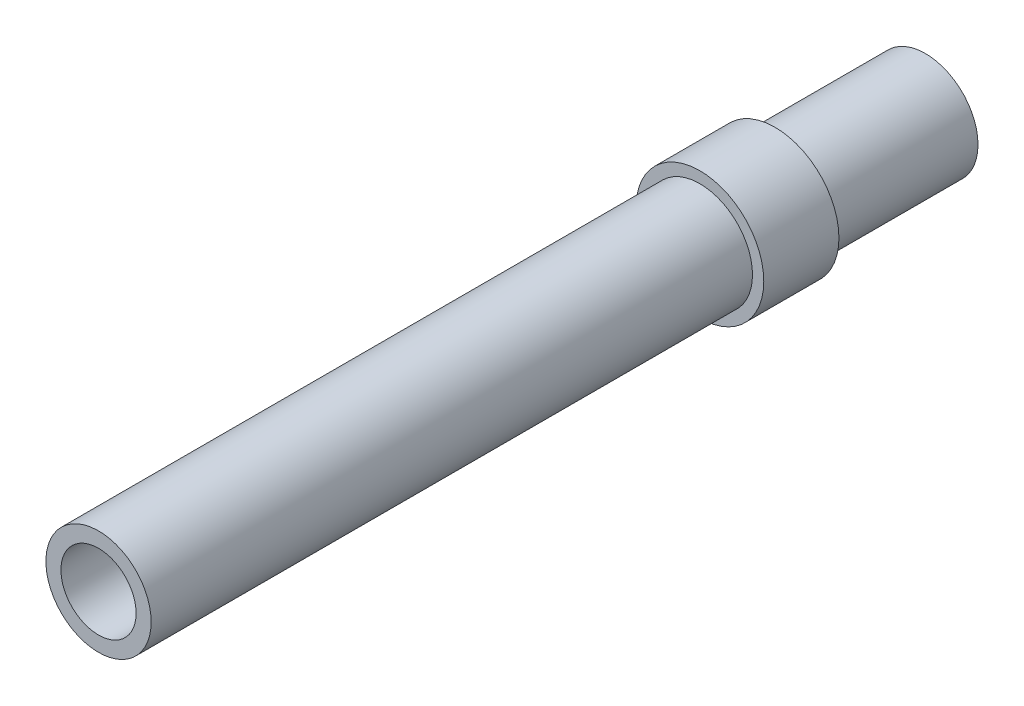
ISO-10303-21;
HEADER;
FILE_DESCRIPTION(('STEP AP214'),'2;1');
FILE_NAME('part.step','',(''),(''),'','','');
FILE_SCHEMA(('AUTOMOTIVE_DESIGN { 1 0 10303 214 1 1 1 1 }'));
ENDSEC;
DATA;
#1=APPLICATION_CONTEXT('core data for automotive mechanical design processes');
#2=APPLICATION_PROTOCOL_DEFINITION('international standard','automotive_design',2000,#1);
#3=PRODUCT_CONTEXT('',#1,'mechanical');
#4=PRODUCT('Part','Part','',(#3));
#5=PRODUCT_RELATED_PRODUCT_CATEGORY('part','',(#4));
#6=PRODUCT_DEFINITION_FORMATION('','',#4);
#7=PRODUCT_DEFINITION_CONTEXT('part definition',#1,'design');
#8=PRODUCT_DEFINITION('design','',#6,#7);
#9=PRODUCT_DEFINITION_SHAPE('','',#8);
#10=(LENGTH_UNIT() NAMED_UNIT(*) SI_UNIT(.MILLI.,.METRE.));
#11=(NAMED_UNIT(*) PLANE_ANGLE_UNIT() SI_UNIT($,.RADIAN.));
#12=(NAMED_UNIT(*) SI_UNIT($,.STERADIAN.) SOLID_ANGLE_UNIT());
#13=UNCERTAINTY_MEASURE_WITH_UNIT(LENGTH_MEASURE(1.E-05),#10,'distance_accuracy_value','');
#14=(GEOMETRIC_REPRESENTATION_CONTEXT(3) GLOBAL_UNCERTAINTY_ASSIGNED_CONTEXT((#13)) GLOBAL_UNIT_ASSIGNED_CONTEXT((#10,
#11,#12)) REPRESENTATION_CONTEXT('',''));
#15=CARTESIAN_POINT('',(0.,0.,0.));
#16=DIRECTION('',(0.,0.,1.));
#17=DIRECTION('',(1.,0.,0.));
#18=AXIS2_PLACEMENT_3D('',#15,#16,#17);
#19=CARTESIAN_POINT('',(0.,0.,50.));
#20=DIRECTION('',(0.,0.,-1.));
#21=DIRECTION('',(-1.,0.,0.));
#22=AXIS2_PLACEMENT_3D('',#19,#20,#21);
#23=CYLINDRICAL_SURFACE('',#22,3.5);
#24=CARTESIAN_POINT('',(0.,0.,15.));
#25=DIRECTION('',(0.,0.,1.));
#26=DIRECTION('',(1.,0.,0.));
#27=AXIS2_PLACEMENT_3D('',#24,#25,#26);
#28=CIRCLE('',#27,3.5);
#29=CARTESIAN_POINT('',(3.5,0.,15.));
#30=VERTEX_POINT('',#29);
#31=EDGE_CURVE('E59',#30,#30,#28,.T.);
#32=ORIENTED_EDGE('',*,*,#31,.T.);
#33=EDGE_LOOP('',(#32));
#34=FACE_BOUND('',#33,.T.);
#35=CARTESIAN_POINT('',(0.,0.,55.));
#36=DIRECTION('',(0.,0.,1.));
#37=DIRECTION('',(1.,0.,0.));
#38=AXIS2_PLACEMENT_3D('',#35,#36,#37);
#39=CIRCLE('',#38,3.5);
#40=CARTESIAN_POINT('',(3.5,0.,55.));
#41=VERTEX_POINT('',#40);
#42=EDGE_CURVE('E63',#41,#41,#39,.T.);
#43=ORIENTED_EDGE('',*,*,#42,.F.);
#44=EDGE_LOOP('',(#43));
#45=FACE_BOUND('',#44,.T.);
#46=ADVANCED_FACE('F41',(#34,#45),#23,.T.);
#47=CARTESIAN_POINT('',(0.,0.,55.));
#48=DIRECTION('',(0.,0.,1.));
#49=DIRECTION('',(1.,0.,0.));
#50=AXIS2_PLACEMENT_3D('',#47,#48,#49);
#51=PLANE('',#50);
#52=CARTESIAN_POINT('',(0.,0.,55.));
#53=DIRECTION('',(0.,0.,1.));
#54=DIRECTION('',(1.,0.,0.));
#55=AXIS2_PLACEMENT_3D('',#52,#53,#54);
#56=CIRCLE('',#55,2.5);
#57=CARTESIAN_POINT('',(2.5,0.,55.));
#58=VERTEX_POINT('',#57);
#59=EDGE_CURVE('E120',#58,#58,#56,.T.);
#60=ORIENTED_EDGE('',*,*,#59,.F.);
#61=EDGE_LOOP('',(#60));
#62=FACE_BOUND('',#61,.T.);
#63=ORIENTED_EDGE('',*,*,#42,.T.);
#64=EDGE_LOOP('',(#63));
#65=FACE_BOUND('',#64,.T.);
#66=ADVANCED_FACE('F85',(#62,#65),#51,.T.);
#67=CARTESIAN_POINT('',(0.,0.,15.));
#68=DIRECTION('',(0.,0.,-1.));
#69=DIRECTION('',(-1.,0.,0.));
#70=AXIS2_PLACEMENT_3D('',#67,#68,#69);
#71=CYLINDRICAL_SURFACE('',#70,4.25);
#72=CARTESIAN_POINT('',(0.,0.,15.));
#73=DIRECTION('',(0.,0.,1.));
#74=DIRECTION('',(1.,0.,0.));
#75=AXIS2_PLACEMENT_3D('',#72,#73,#74);
#76=CIRCLE('',#75,4.25);
#77=CARTESIAN_POINT('',(4.25,0.,15.));
#78=VERTEX_POINT('',#77);
#79=EDGE_CURVE('E64',#78,#78,#76,.T.);
#80=ORIENTED_EDGE('',*,*,#79,.F.);
#81=EDGE_LOOP('',(#80));
#82=FACE_BOUND('',#81,.T.);
#83=CARTESIAN_POINT('',(0.,0.,10.));
#84=DIRECTION('',(0.,0.,1.));
#85=DIRECTION('',(1.,0.,0.));
#86=AXIS2_PLACEMENT_3D('',#83,#84,#85);
#87=CIRCLE('',#86,4.25);
#88=CARTESIAN_POINT('',(4.25,0.,10.));
#89=VERTEX_POINT('',#88);
#90=EDGE_CURVE('E57',#89,#89,#87,.T.);
#91=ORIENTED_EDGE('',*,*,#90,.T.);
#92=EDGE_LOOP('',(#91));
#93=FACE_BOUND('',#92,.T.);
#94=ADVANCED_FACE('F90',(#82,#93),#71,.T.);
#95=CARTESIAN_POINT('',(0.,0.,15.));
#96=DIRECTION('',(0.,0.,1.));
#97=DIRECTION('',(1.,0.,0.));
#98=AXIS2_PLACEMENT_3D('',#95,#96,#97);
#99=PLANE('',#98);
#100=ORIENTED_EDGE('',*,*,#31,.F.);
#101=EDGE_LOOP('',(#100));
#102=FACE_BOUND('',#101,.T.);
#103=ORIENTED_EDGE('',*,*,#79,.T.);
#104=EDGE_LOOP('',(#103));
#105=FACE_BOUND('',#104,.T.);
#106=ADVANCED_FACE('F99',(#102,#105),#99,.T.);
#107=CARTESIAN_POINT('',(0.,0.,10.));
#108=DIRECTION('',(0.,0.,1.));
#109=DIRECTION('',(1.,0.,0.));
#110=AXIS2_PLACEMENT_3D('',#107,#108,#109);
#111=PLANE('',#110);
#112=CARTESIAN_POINT('',(0.,0.,10.));
#113=DIRECTION('',(0.,0.,1.));
#114=DIRECTION('',(1.,0.,0.));
#115=AXIS2_PLACEMENT_3D('',#112,#113,#114);
#116=CIRCLE('',#115,3.5);
#117=CARTESIAN_POINT('',(3.5,0.,10.));
#118=VERTEX_POINT('',#117);
#119=EDGE_CURVE('E10',#118,#118,#116,.T.);
#120=ORIENTED_EDGE('',*,*,#119,.T.);
#121=EDGE_LOOP('',(#120));
#122=FACE_BOUND('',#121,.T.);
#123=ORIENTED_EDGE('',*,*,#90,.F.);
#124=EDGE_LOOP('',(#123));
#125=FACE_BOUND('',#124,.T.);
#126=ADVANCED_FACE('F94',(#122,#125),#111,.F.);
#127=CARTESIAN_POINT('',(0.,0.,0.));
#128=DIRECTION('',(0.,0.,1.));
#129=DIRECTION('',(1.,0.,0.));
#130=AXIS2_PLACEMENT_3D('',#127,#128,#129);
#131=CIRCLE('',#130,3.5);
#132=CARTESIAN_POINT('',(3.5,0.,0.));
#133=VERTEX_POINT('',#132);
#134=EDGE_CURVE('E44',#133,#133,#131,.T.);
#135=ORIENTED_EDGE('',*,*,#134,.T.);
#136=EDGE_LOOP('',(#135));
#137=FACE_BOUND('',#136,.T.);
#138=ORIENTED_EDGE('',*,*,#119,.F.);
#139=EDGE_LOOP('',(#138));
#140=FACE_BOUND('',#139,.T.);
#141=ADVANCED_FACE('F80',(#137,#140),#23,.T.);
#142=CARTESIAN_POINT('',(0.,0.,0.));
#143=DIRECTION('',(0.,0.,1.));
#144=DIRECTION('',(1.,0.,0.));
#145=AXIS2_PLACEMENT_3D('',#142,#143,#144);
#146=PLANE('',#145);
#147=ORIENTED_EDGE('',*,*,#134,.F.);
#148=EDGE_LOOP('',(#147));
#149=FACE_BOUND('',#148,.T.);
#150=CARTESIAN_POINT('',(0.,0.,0.));
#151=DIRECTION('',(0.,0.,1.));
#152=DIRECTION('',(1.,0.,0.));
#153=AXIS2_PLACEMENT_3D('',#150,#151,#152);
#154=CIRCLE('',#153,2.5);
#155=CARTESIAN_POINT('',(2.5,0.,0.));
#156=VERTEX_POINT('',#155);
#157=EDGE_CURVE('E54',#156,#156,#154,.T.);
#158=ORIENTED_EDGE('',*,*,#157,.T.);
#159=EDGE_LOOP('',(#158));
#160=FACE_BOUND('',#159,.T.);
#161=ADVANCED_FACE('F71',(#149,#160),#146,.F.);
#162=CARTESIAN_POINT('',(0.,0.,50.));
#163=DIRECTION('',(0.,0.,-1.));
#164=DIRECTION('',(-1.,0.,0.));
#165=AXIS2_PLACEMENT_3D('',#162,#163,#164);
#166=CYLINDRICAL_SURFACE('',#165,2.5);
#167=ORIENTED_EDGE('',*,*,#59,.T.);
#168=EDGE_LOOP('',(#167));
#169=FACE_BOUND('',#168,.T.);
#170=ORIENTED_EDGE('',*,*,#157,.F.);
#171=EDGE_LOOP('',(#170));
#172=FACE_BOUND('',#171,.T.);
#173=ADVANCED_FACE('F73',(#169,#172),#166,.F.);
#174=CLOSED_SHELL('',(#46,#66,#94,#106,#126,#141,#161,#173));
#175=MANIFOLD_SOLID_BREP('B2',#174);
#176=ADVANCED_BREP_SHAPE_REPRESENTATION('',(#18,#175),#14);
#177=SHAPE_DEFINITION_REPRESENTATION(#9,#176);
ENDSEC;
END-ISO-10303-21;
